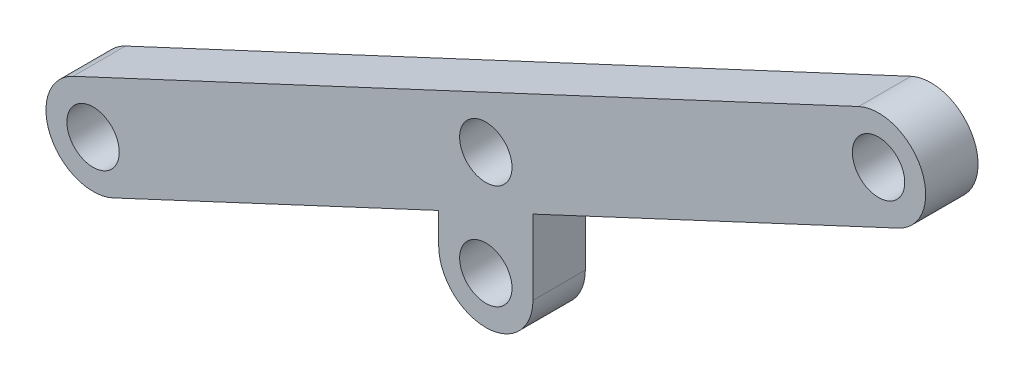
ISO-10303-21;
HEADER;
FILE_DESCRIPTION(('STEP AP214'),'2;1');
FILE_NAME('part.step','',(''),(''),'','','');
FILE_SCHEMA(('AUTOMOTIVE_DESIGN { 1 0 10303 214 1 1 1 1 }'));
ENDSEC;
DATA;
#1=APPLICATION_CONTEXT('core data for automotive mechanical design processes');
#2=APPLICATION_PROTOCOL_DEFINITION('international standard','automotive_design',2000,#1);
#3=PRODUCT_CONTEXT('',#1,'mechanical');
#4=PRODUCT('Part','Part','',(#3));
#5=PRODUCT_RELATED_PRODUCT_CATEGORY('part','',(#4));
#6=PRODUCT_DEFINITION_FORMATION('','',#4);
#7=PRODUCT_DEFINITION_CONTEXT('part definition',#1,'design');
#8=PRODUCT_DEFINITION('design','',#6,#7);
#9=PRODUCT_DEFINITION_SHAPE('','',#8);
#10=(LENGTH_UNIT() NAMED_UNIT(*) SI_UNIT(.MILLI.,.METRE.));
#11=(NAMED_UNIT(*) PLANE_ANGLE_UNIT() SI_UNIT($,.RADIAN.));
#12=(NAMED_UNIT(*) SI_UNIT($,.STERADIAN.) SOLID_ANGLE_UNIT());
#13=UNCERTAINTY_MEASURE_WITH_UNIT(LENGTH_MEASURE(1.E-05),#10,'distance_accuracy_value','');
#14=(GEOMETRIC_REPRESENTATION_CONTEXT(3) GLOBAL_UNCERTAINTY_ASSIGNED_CONTEXT((#13)) GLOBAL_UNIT_ASSIGNED_CONTEXT((#10,
#11,#12)) REPRESENTATION_CONTEXT('',''));
#15=CARTESIAN_POINT('',(0.,0.,0.));
#16=DIRECTION('',(0.,0.,1.));
#17=DIRECTION('',(1.,0.,0.));
#18=AXIS2_PLACEMENT_3D('',#15,#16,#17);
#19=CARTESIAN_POINT('',(0.,-5.,2.5));
#20=DIRECTION('',(0.,0.,1.));
#21=DIRECTION('',(1.,0.,0.));
#22=AXIS2_PLACEMENT_3D('',#19,#20,#21);
#23=PLANE('',#22);
#24=DIRECTION('',(0.,1.,0.));
#25=VECTOR('',#24,1.);
#26=CARTESIAN_POINT('',(4.5,-5.,2.5));
#27=LINE('',#26,#25);
#28=CARTESIAN_POINT('',(4.5,-5.,2.5));
#29=VERTEX_POINT('',#28);
#30=CARTESIAN_POINT('',(4.5,2.13411639282594,2.5));
#31=VERTEX_POINT('',#30);
#32=EDGE_CURVE('E160',#29,#31,#27,.T.);
#33=ORIENTED_EDGE('',*,*,#32,.T.);
#34=DIRECTION('',(0.906183139995265,0.422885465331124,0.));
#35=VECTOR('',#34,1.);
#36=CARTESIAN_POINT('',(-35.5970154060099,-16.5778241299787,2.5));
#37=LINE('',#36,#35);
#38=CARTESIAN_POINT('',(39.4029845939901,18.4221758700213,2.5));
#39=VERTEX_POINT('',#38);
#40=EDGE_CURVE('E120',#31,#39,#37,.T.);
#41=ORIENTED_EDGE('',*,*,#40,.T.);
#42=CARTESIAN_POINT('',(37.5,22.5,2.5));
#43=DIRECTION('',(0.,0.,1.));
#44=DIRECTION('',(1.,0.,0.));
#45=AXIS2_PLACEMENT_3D('',#42,#43,#44);
#46=CIRCLE('',#45,4.50000000000001);
#47=CARTESIAN_POINT('',(35.59701540601,26.5778241299787,2.5));
#48=VERTEX_POINT('',#47);
#49=EDGE_CURVE('E119',#39,#48,#46,.T.);
#50=ORIENTED_EDGE('',*,*,#49,.T.);
#51=DIRECTION('',(-0.906183139995265,-0.422885465331124,0.));
#52=VECTOR('',#51,1.);
#53=CARTESIAN_POINT('',(-39.4029845939901,-8.42217587002131,2.5));
#54=LINE('',#53,#52);
#55=CARTESIAN_POINT('',(-39.4029845939901,-8.42217587002131,2.5));
#56=VERTEX_POINT('',#55);
#57=EDGE_CURVE('E112',#48,#56,#54,.T.);
#58=ORIENTED_EDGE('',*,*,#57,.T.);
#59=CARTESIAN_POINT('',(-37.5,-12.5,2.5));
#60=DIRECTION('',(0.,0.,1.));
#61=DIRECTION('',(1.,0.,0.));
#62=AXIS2_PLACEMENT_3D('',#59,#60,#61);
#63=CIRCLE('',#62,4.50000000000001);
#64=CARTESIAN_POINT('',(-35.5970154060099,-16.5778241299787,2.5));
#65=VERTEX_POINT('',#64);
#66=EDGE_CURVE('E106',#56,#65,#63,.T.);
#67=ORIENTED_EDGE('',*,*,#66,.T.);
#68=CARTESIAN_POINT('',(-4.5,-2.06588360717407,2.5));
#69=VERTEX_POINT('',#68);
#70=EDGE_CURVE('E116',#65,#69,#37,.T.);
#71=ORIENTED_EDGE('',*,*,#70,.T.);
#72=DIRECTION('',(0.,-1.,0.));
#73=VECTOR('',#72,1.);
#74=CARTESIAN_POINT('',(-4.5,-5.,2.5));
#75=LINE('',#74,#73);
#76=CARTESIAN_POINT('',(-4.5,-5.,2.5));
#77=VERTEX_POINT('',#76);
#78=EDGE_CURVE('E163',#69,#77,#75,.T.);
#79=ORIENTED_EDGE('',*,*,#78,.T.);
#80=CARTESIAN_POINT('',(0.,-5.,2.5));
#81=DIRECTION('',(0.,0.,1.));
#82=DIRECTION('',(1.,0.,0.));
#83=AXIS2_PLACEMENT_3D('',#80,#81,#82);
#84=CIRCLE('',#83,4.5);
#85=EDGE_CURVE('E157',#77,#29,#84,.T.);
#86=ORIENTED_EDGE('',*,*,#85,.T.);
#87=EDGE_LOOP('',(#33,#41,#50,#58,#67,#71,#79,#86));
#88=FACE_BOUND('',#87,.T.);
#89=CARTESIAN_POINT('',(0.,-5.,2.5));
#90=DIRECTION('',(0.,0.,1.));
#91=DIRECTION('',(1.,0.,0.));
#92=AXIS2_PLACEMENT_3D('',#89,#90,#91);
#93=CIRCLE('',#92,2.5);
#94=CARTESIAN_POINT('',(2.5,-5.,2.5));
#95=VERTEX_POINT('',#94);
#96=EDGE_CURVE('E145',#95,#95,#93,.T.);
#97=ORIENTED_EDGE('',*,*,#96,.F.);
#98=EDGE_LOOP('',(#97));
#99=FACE_BOUND('',#98,.T.);
#100=CARTESIAN_POINT('',(0.,5.,2.5));
#101=DIRECTION('',(0.,0.,1.));
#102=DIRECTION('',(1.,0.,0.));
#103=AXIS2_PLACEMENT_3D('',#100,#101,#102);
#104=CIRCLE('',#103,2.5);
#105=CARTESIAN_POINT('',(2.5,5.,2.5));
#106=VERTEX_POINT('',#105);
#107=EDGE_CURVE('E151',#106,#106,#104,.T.);
#108=ORIENTED_EDGE('',*,*,#107,.F.);
#109=EDGE_LOOP('',(#108));
#110=FACE_BOUND('',#109,.T.);
#111=CARTESIAN_POINT('',(-37.5,-12.5,2.5));
#112=DIRECTION('',(0.,0.,1.));
#113=DIRECTION('',(1.,0.,0.));
#114=AXIS2_PLACEMENT_3D('',#111,#112,#113);
#115=CIRCLE('',#114,2.5);
#116=CARTESIAN_POINT('',(-35.,-12.5,2.5));
#117=VERTEX_POINT('',#116);
#118=EDGE_CURVE('E126',#117,#117,#115,.T.);
#119=ORIENTED_EDGE('',*,*,#118,.F.);
#120=EDGE_LOOP('',(#119));
#121=FACE_BOUND('',#120,.T.);
#122=CARTESIAN_POINT('',(37.5,22.5,2.5));
#123=DIRECTION('',(0.,0.,1.));
#124=DIRECTION('',(1.,0.,0.));
#125=AXIS2_PLACEMENT_3D('',#122,#123,#124);
#126=CIRCLE('',#125,2.5);
#127=CARTESIAN_POINT('',(40.,22.5,2.5));
#128=VERTEX_POINT('',#127);
#129=EDGE_CURVE('E129',#128,#128,#126,.T.);
#130=ORIENTED_EDGE('',*,*,#129,.F.);
#131=EDGE_LOOP('',(#130));
#132=FACE_BOUND('',#131,.T.);
#133=ADVANCED_FACE('F37',(#88,#99,#110,#121,#132),#23,.T.);
#134=CARTESIAN_POINT('',(0.,-5.,-2.5));
#135=DIRECTION('',(0.,0.,1.));
#136=DIRECTION('',(1.,0.,0.));
#137=AXIS2_PLACEMENT_3D('',#134,#135,#136);
#138=PLANE('',#137);
#139=DIRECTION('',(0.,-1.,0.));
#140=VECTOR('',#139,1.);
#141=CARTESIAN_POINT('',(-4.5,-5.,-2.5));
#142=LINE('',#141,#140);
#143=CARTESIAN_POINT('',(-4.5,-2.06588360717407,-2.5));
#144=VERTEX_POINT('',#143);
#145=CARTESIAN_POINT('',(-4.5,-5.,-2.5));
#146=VERTEX_POINT('',#145);
#147=EDGE_CURVE('E161',#144,#146,#142,.T.);
#148=ORIENTED_EDGE('',*,*,#147,.F.);
#149=DIRECTION('',(-0.906183139995266,-0.422885465331124,0.));
#150=VECTOR('',#149,1.);
#151=CARTESIAN_POINT('',(-35.5970154060099,-16.5778241299787,-2.5));
#152=LINE('',#151,#150);
#153=CARTESIAN_POINT('',(-35.5970154060099,-16.5778241299787,-2.5));
#154=VERTEX_POINT('',#153);
#155=EDGE_CURVE('E187',#144,#154,#152,.T.);
#156=ORIENTED_EDGE('',*,*,#155,.T.);
#157=CARTESIAN_POINT('',(-37.5,-12.5,-2.5));
#158=DIRECTION('',(0.,0.,1.));
#159=DIRECTION('',(1.,0.,0.));
#160=AXIS2_PLACEMENT_3D('',#157,#158,#159);
#161=CIRCLE('',#160,4.50000000000001);
#162=CARTESIAN_POINT('',(-39.4029845939901,-8.42217587002131,-2.5));
#163=VERTEX_POINT('',#162);
#164=EDGE_CURVE('E108',#154,#163,#161,.F.);
#165=ORIENTED_EDGE('',*,*,#164,.T.);
#166=DIRECTION('',(0.906183139995266,0.422885465331124,0.));
#167=VECTOR('',#166,1.);
#168=CARTESIAN_POINT('',(-39.4029845939901,-8.42217587002131,-2.5));
#169=LINE('',#168,#167);
#170=CARTESIAN_POINT('',(35.59701540601,26.5778241299787,-2.5));
#171=VERTEX_POINT('',#170);
#172=EDGE_CURVE('E194',#163,#171,#169,.T.);
#173=ORIENTED_EDGE('',*,*,#172,.T.);
#174=CARTESIAN_POINT('',(37.5,22.5,-2.5));
#175=DIRECTION('',(0.,0.,1.));
#176=DIRECTION('',(1.,0.,0.));
#177=AXIS2_PLACEMENT_3D('',#174,#175,#176);
#178=CIRCLE('',#177,4.50000000000001);
#179=CARTESIAN_POINT('',(39.4029845939901,18.4221758700213,-2.5));
#180=VERTEX_POINT('',#179);
#181=EDGE_CURVE('E137',#171,#180,#178,.F.);
#182=ORIENTED_EDGE('',*,*,#181,.T.);
#183=CARTESIAN_POINT('',(4.5,2.13411639282593,-2.5));
#184=VERTEX_POINT('',#183);
#185=EDGE_CURVE('E182',#180,#184,#152,.T.);
#186=ORIENTED_EDGE('',*,*,#185,.T.);
#187=DIRECTION('',(0.,1.,0.));
#188=VECTOR('',#187,1.);
#189=CARTESIAN_POINT('',(4.5,-5.,-2.5));
#190=LINE('',#189,#188);
#191=CARTESIAN_POINT('',(4.5,-5.,-2.5));
#192=VERTEX_POINT('',#191);
#193=EDGE_CURVE('E57',#192,#184,#190,.T.);
#194=ORIENTED_EDGE('',*,*,#193,.F.);
#195=CARTESIAN_POINT('',(0.,-5.,-2.5));
#196=DIRECTION('',(0.,0.,1.));
#197=DIRECTION('',(1.,0.,0.));
#198=AXIS2_PLACEMENT_3D('',#195,#196,#197);
#199=CIRCLE('',#198,4.5);
#200=EDGE_CURVE('E154',#146,#192,#199,.T.);
#201=ORIENTED_EDGE('',*,*,#200,.F.);
#202=EDGE_LOOP('',(#148,#156,#165,#173,#182,#186,#194,#201));
#203=FACE_BOUND('',#202,.T.);
#204=CARTESIAN_POINT('',(0.,-5.,-2.5));
#205=DIRECTION('',(0.,0.,1.));
#206=DIRECTION('',(1.,0.,0.));
#207=AXIS2_PLACEMENT_3D('',#204,#205,#206);
#208=CIRCLE('',#207,2.5);
#209=CARTESIAN_POINT('',(2.5,-5.,-2.5));
#210=VERTEX_POINT('',#209);
#211=EDGE_CURVE('E143',#210,#210,#208,.T.);
#212=ORIENTED_EDGE('',*,*,#211,.T.);
#213=EDGE_LOOP('',(#212));
#214=FACE_BOUND('',#213,.T.);
#215=CARTESIAN_POINT('',(0.,5.,-2.5));
#216=DIRECTION('',(0.,0.,1.));
#217=DIRECTION('',(1.,0.,0.));
#218=AXIS2_PLACEMENT_3D('',#215,#216,#217);
#219=CIRCLE('',#218,2.5);
#220=CARTESIAN_POINT('',(2.5,5.,-2.5));
#221=VERTEX_POINT('',#220);
#222=EDGE_CURVE('E148',#221,#221,#219,.T.);
#223=ORIENTED_EDGE('',*,*,#222,.T.);
#224=EDGE_LOOP('',(#223));
#225=FACE_BOUND('',#224,.T.);
#226=CARTESIAN_POINT('',(-37.5,-12.5,-2.5));
#227=DIRECTION('',(0.,0.,1.));
#228=DIRECTION('',(1.,0.,0.));
#229=AXIS2_PLACEMENT_3D('',#226,#227,#228);
#230=CIRCLE('',#229,2.5);
#231=CARTESIAN_POINT('',(-35.,-12.5,-2.5));
#232=VERTEX_POINT('',#231);
#233=EDGE_CURVE('E144',#232,#232,#230,.F.);
#234=ORIENTED_EDGE('',*,*,#233,.F.);
#235=EDGE_LOOP('',(#234));
#236=FACE_BOUND('',#235,.T.);
#237=CARTESIAN_POINT('',(37.5,22.5,-2.5));
#238=DIRECTION('',(0.,0.,1.));
#239=DIRECTION('',(1.,0.,0.));
#240=AXIS2_PLACEMENT_3D('',#237,#238,#239);
#241=CIRCLE('',#240,2.5);
#242=CARTESIAN_POINT('',(40.,22.5,-2.5));
#243=VERTEX_POINT('',#242);
#244=EDGE_CURVE('E186',#243,#243,#241,.F.);
#245=ORIENTED_EDGE('',*,*,#244,.F.);
#246=EDGE_LOOP('',(#245));
#247=FACE_BOUND('',#246,.T.);
#248=ADVANCED_FACE('F178',(#203,#214,#225,#236,#247),#138,.F.);
#249=CARTESIAN_POINT('',(0.,-5.,2.5));
#250=DIRECTION('',(0.,0.,-1.));
#251=DIRECTION('',(-1.,0.,0.));
#252=AXIS2_PLACEMENT_3D('',#249,#250,#251);
#253=CYLINDRICAL_SURFACE('',#252,4.5);
#254=ORIENTED_EDGE('',*,*,#200,.T.);
#255=DIRECTION('',(0.,0.,-1.));
#256=VECTOR('',#255,1.);
#257=CARTESIAN_POINT('',(4.5,-5.,2.5));
#258=LINE('',#257,#256);
#259=EDGE_CURVE('E45',#29,#192,#258,.T.);
#260=ORIENTED_EDGE('',*,*,#259,.F.);
#261=ORIENTED_EDGE('',*,*,#85,.F.);
#262=DIRECTION('',(0.,0.,-1.));
#263=VECTOR('',#262,1.);
#264=CARTESIAN_POINT('',(-4.5,-5.,2.5));
#265=LINE('',#264,#263);
#266=EDGE_CURVE('E165',#77,#146,#265,.T.);
#267=ORIENTED_EDGE('',*,*,#266,.T.);
#268=EDGE_LOOP('',(#254,#260,#261,#267));
#269=FACE_BOUND('',#268,.T.);
#270=ADVANCED_FACE('F39',(#269),#253,.T.);
#271=CARTESIAN_POINT('',(4.5,-5.,2.5));
#272=DIRECTION('',(-1.,0.,0.));
#273=DIRECTION('',(0.,-1.,0.));
#274=AXIS2_PLACEMENT_3D('',#271,#272,#273);
#275=PLANE('',#274);
#276=ORIENTED_EDGE('',*,*,#193,.T.);
#277=DIRECTION('',(0.,0.,1.));
#278=VECTOR('',#277,1.);
#279=CARTESIAN_POINT('',(4.5,2.13411639282594,2.5));
#280=LINE('',#279,#278);
#281=EDGE_CURVE('E52',#184,#31,#280,.T.);
#282=ORIENTED_EDGE('',*,*,#281,.T.);
#283=ORIENTED_EDGE('',*,*,#32,.F.);
#284=ORIENTED_EDGE('',*,*,#259,.T.);
#285=EDGE_LOOP('',(#276,#282,#283,#284));
#286=FACE_BOUND('',#285,.T.);
#287=ADVANCED_FACE('F172',(#286),#275,.F.);
#288=CARTESIAN_POINT('',(-4.5,-5.,2.5));
#289=DIRECTION('',(1.,0.,0.));
#290=DIRECTION('',(0.,1.,0.));
#291=AXIS2_PLACEMENT_3D('',#288,#289,#290);
#292=PLANE('',#291);
#293=ORIENTED_EDGE('',*,*,#78,.F.);
#294=DIRECTION('',(0.,0.,-1.));
#295=VECTOR('',#294,1.);
#296=CARTESIAN_POINT('',(-4.5,-2.06588360717407,2.5));
#297=LINE('',#296,#295);
#298=EDGE_CURVE('E11',#69,#144,#297,.T.);
#299=ORIENTED_EDGE('',*,*,#298,.T.);
#300=ORIENTED_EDGE('',*,*,#147,.T.);
#301=ORIENTED_EDGE('',*,*,#266,.F.);
#302=EDGE_LOOP('',(#293,#299,#300,#301));
#303=FACE_BOUND('',#302,.T.);
#304=ADVANCED_FACE('F211',(#303),#292,.F.);
#305=CARTESIAN_POINT('',(0.,5.,2.5));
#306=DIRECTION('',(0.,0.,-1.));
#307=DIRECTION('',(-1.,0.,0.));
#308=AXIS2_PLACEMENT_3D('',#305,#306,#307);
#309=CYLINDRICAL_SURFACE('',#308,2.5);
#310=ORIENTED_EDGE('',*,*,#107,.T.);
#311=EDGE_LOOP('',(#310));
#312=FACE_BOUND('',#311,.T.);
#313=ORIENTED_EDGE('',*,*,#222,.F.);
#314=EDGE_LOOP('',(#313));
#315=FACE_BOUND('',#314,.T.);
#316=ADVANCED_FACE('F208',(#312,#315),#309,.F.);
#317=CARTESIAN_POINT('',(0.,-5.,2.5));
#318=DIRECTION('',(0.,0.,-1.));
#319=DIRECTION('',(-1.,0.,0.));
#320=AXIS2_PLACEMENT_3D('',#317,#318,#319);
#321=CYLINDRICAL_SURFACE('',#320,2.5);
#322=ORIENTED_EDGE('',*,*,#96,.T.);
#323=EDGE_LOOP('',(#322));
#324=FACE_BOUND('',#323,.T.);
#325=ORIENTED_EDGE('',*,*,#211,.F.);
#326=EDGE_LOOP('',(#325));
#327=FACE_BOUND('',#326,.T.);
#328=ADVANCED_FACE('F252',(#324,#327),#321,.F.);
#329=CARTESIAN_POINT('',(-39.4029845939901,-8.42217587002131,-97.3261567290376));
#330=DIRECTION('',(-0.422885465331124,0.906183139995265,0.));
#331=DIRECTION('',(-0.906183139995266,-0.422885465331124,0.));
#332=AXIS2_PLACEMENT_3D('',#329,#330,#331);
#333=PLANE('',#332);
#334=ORIENTED_EDGE('',*,*,#172,.F.);
#335=DIRECTION('',(0.,0.,1.));
#336=VECTOR('',#335,1.);
#337=CARTESIAN_POINT('',(-39.4029845939901,-8.42217587002131,-97.3261567290376));
#338=LINE('',#337,#336);
#339=EDGE_CURVE('E135',#163,#56,#338,.T.);
#340=ORIENTED_EDGE('',*,*,#339,.T.);
#341=ORIENTED_EDGE('',*,*,#57,.F.);
#342=DIRECTION('',(0.,0.,1.));
#343=VECTOR('',#342,1.);
#344=CARTESIAN_POINT('',(35.59701540601,26.5778241299787,-97.3261567290376));
#345=LINE('',#344,#343);
#346=EDGE_CURVE('E138',#171,#48,#345,.T.);
#347=ORIENTED_EDGE('',*,*,#346,.F.);
#348=EDGE_LOOP('',(#334,#340,#341,#347));
#349=FACE_BOUND('',#348,.T.);
#350=ADVANCED_FACE('F247',(#349),#333,.T.);
#351=CARTESIAN_POINT('',(-35.5970154060099,-16.5778241299787,-97.3261567290376));
#352=DIRECTION('',(0.422885465331124,-0.906183139995265,0.));
#353=DIRECTION('',(0.906183139995266,0.422885465331124,0.));
#354=AXIS2_PLACEMENT_3D('',#351,#352,#353);
#355=PLANE('',#354);
#356=ORIENTED_EDGE('',*,*,#281,.F.);
#357=ORIENTED_EDGE('',*,*,#185,.F.);
#358=DIRECTION('',(0.,0.,1.));
#359=VECTOR('',#358,1.);
#360=CARTESIAN_POINT('',(39.4029845939901,18.4221758700213,-97.3261567290376));
#361=LINE('',#360,#359);
#362=EDGE_CURVE('E111',#180,#39,#361,.T.);
#363=ORIENTED_EDGE('',*,*,#362,.T.);
#364=ORIENTED_EDGE('',*,*,#40,.F.);
#365=EDGE_LOOP('',(#356,#357,#363,#364));
#366=FACE_BOUND('',#365,.T.);
#367=ADVANCED_FACE('F251',(#366),#355,.T.);
#368=ORIENTED_EDGE('',*,*,#298,.F.);
#369=ORIENTED_EDGE('',*,*,#70,.F.);
#370=DIRECTION('',(0.,0.,1.));
#371=VECTOR('',#370,1.);
#372=CARTESIAN_POINT('',(-35.5970154060099,-16.5778241299787,-97.3261567290376));
#373=LINE('',#372,#371);
#374=EDGE_CURVE('E101',#154,#65,#373,.T.);
#375=ORIENTED_EDGE('',*,*,#374,.F.);
#376=ORIENTED_EDGE('',*,*,#155,.F.);
#377=EDGE_LOOP('',(#368,#369,#375,#376));
#378=FACE_BOUND('',#377,.T.);
#379=ADVANCED_FACE('F117',(#378),#355,.T.);
#380=CARTESIAN_POINT('',(37.5,22.5,-97.3261567290376));
#381=DIRECTION('',(0.,0.,1.));
#382=DIRECTION('',(1.,0.,0.));
#383=AXIS2_PLACEMENT_3D('',#380,#381,#382);
#384=CYLINDRICAL_SURFACE('',#383,4.50000000000001);
#385=ORIENTED_EDGE('',*,*,#181,.F.);
#386=ORIENTED_EDGE('',*,*,#346,.T.);
#387=ORIENTED_EDGE('',*,*,#49,.F.);
#388=ORIENTED_EDGE('',*,*,#362,.F.);
#389=EDGE_LOOP('',(#385,#386,#387,#388));
#390=FACE_BOUND('',#389,.T.);
#391=ADVANCED_FACE('F271',(#390),#384,.T.);
#392=CARTESIAN_POINT('',(-37.5,-12.5,-97.3261567290376));
#393=DIRECTION('',(0.,0.,1.));
#394=DIRECTION('',(1.,0.,0.));
#395=AXIS2_PLACEMENT_3D('',#392,#393,#394);
#396=CYLINDRICAL_SURFACE('',#395,4.50000000000001);
#397=ORIENTED_EDGE('',*,*,#164,.F.);
#398=ORIENTED_EDGE('',*,*,#374,.T.);
#399=ORIENTED_EDGE('',*,*,#66,.F.);
#400=ORIENTED_EDGE('',*,*,#339,.F.);
#401=EDGE_LOOP('',(#397,#398,#399,#400));
#402=FACE_BOUND('',#401,.T.);
#403=ADVANCED_FACE('F103',(#402),#396,.T.);
#404=CARTESIAN_POINT('',(-37.5,-12.5,-97.3261567290376));
#405=DIRECTION('',(0.,0.,1.));
#406=DIRECTION('',(1.,0.,0.));
#407=AXIS2_PLACEMENT_3D('',#404,#405,#406);
#408=CYLINDRICAL_SURFACE('',#407,2.5);
#409=ORIENTED_EDGE('',*,*,#233,.T.);
#410=EDGE_LOOP('',(#409));
#411=FACE_BOUND('',#410,.T.);
#412=ORIENTED_EDGE('',*,*,#118,.T.);
#413=EDGE_LOOP('',(#412));
#414=FACE_BOUND('',#413,.T.);
#415=ADVANCED_FACE('F288',(#411,#414),#408,.F.);
#416=CARTESIAN_POINT('',(37.5,22.5,-97.3261567290376));
#417=DIRECTION('',(0.,0.,1.));
#418=DIRECTION('',(1.,0.,0.));
#419=AXIS2_PLACEMENT_3D('',#416,#417,#418);
#420=CYLINDRICAL_SURFACE('',#419,2.5);
#421=ORIENTED_EDGE('',*,*,#244,.T.);
#422=EDGE_LOOP('',(#421));
#423=FACE_BOUND('',#422,.T.);
#424=ORIENTED_EDGE('',*,*,#129,.T.);
#425=EDGE_LOOP('',(#424));
#426=FACE_BOUND('',#425,.T.);
#427=ADVANCED_FACE('F199',(#423,#426),#420,.F.);
#428=CLOSED_SHELL('',(#133,#248,#270,#287,#304,#316,#328,#350,#367,#379,#391,#403,#415,#427));
#429=MANIFOLD_SOLID_BREP('B2',#428);
#430=ADVANCED_BREP_SHAPE_REPRESENTATION('',(#18,#429),#14);
#431=SHAPE_DEFINITION_REPRESENTATION(#9,#430);
ENDSEC;
END-ISO-10303-21;
